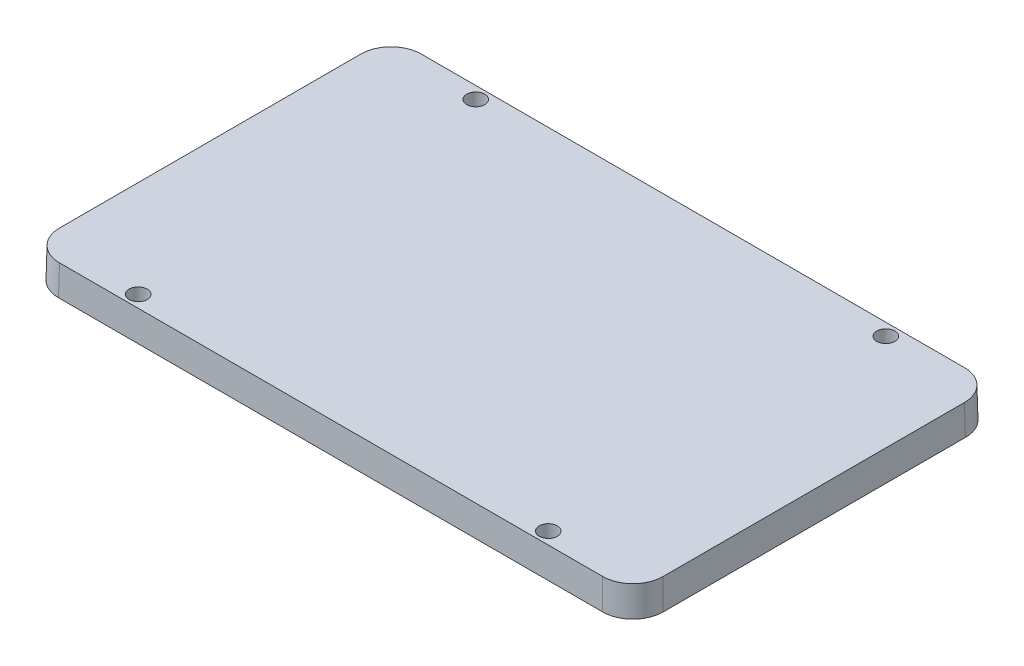
ISO-10303-21;
HEADER;
FILE_DESCRIPTION(('STEP AP214'),'2;1');
FILE_NAME('part.step','',(''),(''),'','','');
FILE_SCHEMA(('AUTOMOTIVE_DESIGN { 1 0 10303 214 1 1 1 1 }'));
ENDSEC;
DATA;
#1=APPLICATION_CONTEXT('core data for automotive mechanical design processes');
#2=APPLICATION_PROTOCOL_DEFINITION('international standard','automotive_design',2000,#1);
#3=PRODUCT_CONTEXT('',#1,'mechanical');
#4=PRODUCT('Part','Part','',(#3));
#5=PRODUCT_RELATED_PRODUCT_CATEGORY('part','',(#4));
#6=PRODUCT_DEFINITION_FORMATION('','',#4);
#7=PRODUCT_DEFINITION_CONTEXT('part definition',#1,'design');
#8=PRODUCT_DEFINITION('design','',#6,#7);
#9=PRODUCT_DEFINITION_SHAPE('','',#8);
#10=(LENGTH_UNIT() NAMED_UNIT(*) SI_UNIT(.MILLI.,.METRE.));
#11=(NAMED_UNIT(*) PLANE_ANGLE_UNIT() SI_UNIT($,.RADIAN.));
#12=(NAMED_UNIT(*) SI_UNIT($,.STERADIAN.) SOLID_ANGLE_UNIT());
#13=UNCERTAINTY_MEASURE_WITH_UNIT(LENGTH_MEASURE(1.E-05),#10,'distance_accuracy_value','');
#14=(GEOMETRIC_REPRESENTATION_CONTEXT(3) GLOBAL_UNCERTAINTY_ASSIGNED_CONTEXT((#13)) GLOBAL_UNIT_ASSIGNED_CONTEXT((#10,
#11,#12)) REPRESENTATION_CONTEXT('',''));
#15=CARTESIAN_POINT('',(0.,0.,0.));
#16=DIRECTION('',(0.,0.,1.));
#17=DIRECTION('',(1.,0.,0.));
#18=AXIS2_PLACEMENT_3D('',#15,#16,#17);
#19=CARTESIAN_POINT('',(52.5,-0.124913922395171,-31.5));
#20=DIRECTION('',(0.999847695156391,0.0174524064372835,0.));
#21=DIRECTION('',(-0.0174524064372835,0.999847695156391,0.));
#22=AXIS2_PLACEMENT_3D('',#19,#20,#21);
#23=PLANE('',#22);
#24=DIRECTION('',(0.,0.,1.));
#25=VECTOR('',#24,1.);
#26=CARTESIAN_POINT('',(52.4083609091269,5.12508607760483,-31.5));
#27=LINE('',#26,#25);
#28=CARTESIAN_POINT('',(52.4083609091269,5.12508607760483,26.1591605095558));
#29=VERTEX_POINT('',#28);
#30=CARTESIAN_POINT('',(52.4083609091269,5.12508607760483,-26.1591605095558));
#31=VERTEX_POINT('',#30);
#32=EDGE_CURVE('E130',#29,#31,#27,.F.);
#33=ORIENTED_EDGE('',*,*,#32,.F.);
#34=DIRECTION('',(-0.0174497491606827,0.999695459881888,-0.0174497491606827));
#35=VECTOR('',#34,1.);
#36=CARTESIAN_POINT('',(52.4824152427084,0.882516148126258,26.2332148431373));
#37=LINE('',#36,#35);
#38=CARTESIAN_POINT('',(52.5,-0.124913922395171,26.2507996004289));
#39=VERTEX_POINT('',#38);
#40=EDGE_CURVE('E114',#29,#39,#37,.F.);
#41=ORIENTED_EDGE('',*,*,#40,.T.);
#42=DIRECTION('',(0.,0.,-1.));
#43=VECTOR('',#42,1.);
#44=CARTESIAN_POINT('',(52.5,-0.124913922395171,-31.5));
#45=LINE('',#44,#43);
#46=CARTESIAN_POINT('',(52.5,-0.124913922395171,-26.2507996004289));
#47=VERTEX_POINT('',#46);
#48=EDGE_CURVE('E127',#39,#47,#45,.T.);
#49=ORIENTED_EDGE('',*,*,#48,.T.);
#50=DIRECTION('',(-0.0174497491606827,0.999695459881888,0.0174497491606827));
#51=VECTOR('',#50,1.);
#52=CARTESIAN_POINT('',(52.501598348692,-0.216483257630517,-26.2523979491209));
#53=LINE('',#52,#51);
#54=EDGE_CURVE('E133',#47,#31,#53,.T.);
#55=ORIENTED_EDGE('',*,*,#54,.T.);
#56=EDGE_LOOP('',(#33,#41,#49,#55));
#57=FACE_BOUND('',#56,.T.);
#58=ADVANCED_FACE('F43',(#57),#23,.T.);
#59=CARTESIAN_POINT('',(-52.5,-0.124913922395171,-31.5));
#60=DIRECTION('',(0.,0.0174524064372835,-0.999847695156391));
#61=DIRECTION('',(0.,0.999847695156391,0.0174524064372835));
#62=AXIS2_PLACEMENT_3D('',#59,#60,#61);
#63=PLANE('',#62);
#64=DIRECTION('',(1.,0.,0.));
#65=VECTOR('',#64,1.);
#66=CARTESIAN_POINT('',(-52.5,5.12508607760483,-31.4083609091269));
#67=LINE('',#66,#65);
#68=CARTESIAN_POINT('',(47.1591605095558,5.12508607760483,-31.4083609091269));
#69=VERTEX_POINT('',#68);
#70=CARTESIAN_POINT('',(-47.1591605095558,5.12508607760483,-31.4083609091269));
#71=VERTEX_POINT('',#70);
#72=EDGE_CURVE('E158',#69,#71,#67,.F.);
#73=ORIENTED_EDGE('',*,*,#72,.F.);
#74=DIRECTION('',(-0.0174497491606827,0.999695459881888,0.0174497491606827));
#75=VECTOR('',#74,1.);
#76=CARTESIAN_POINT('',(47.220426105815,1.61518241863077,-31.469626505386));
#77=LINE('',#76,#75);
#78=CARTESIAN_POINT('',(47.2507996004289,-0.124913922395171,-31.5));
#79=VERTEX_POINT('',#78);
#80=EDGE_CURVE('E196',#69,#79,#77,.F.);
#81=ORIENTED_EDGE('',*,*,#80,.T.);
#82=DIRECTION('',(-1.,0.,0.));
#83=VECTOR('',#82,1.);
#84=CARTESIAN_POINT('',(-52.5,-0.124913922395171,-31.5));
#85=LINE('',#84,#83);
#86=CARTESIAN_POINT('',(-47.2507996004289,-0.124913922395171,-31.5));
#87=VERTEX_POINT('',#86);
#88=EDGE_CURVE('E138',#79,#87,#85,.T.);
#89=ORIENTED_EDGE('',*,*,#88,.T.);
#90=DIRECTION('',(0.0174497491606827,0.999695459881888,0.0174497491606827));
#91=VECTOR('',#90,1.);
#92=CARTESIAN_POINT('',(-47.2523979491209,-0.216483257630517,-31.501598348692));
#93=LINE('',#92,#91);
#94=EDGE_CURVE('E193',#87,#71,#93,.T.);
#95=ORIENTED_EDGE('',*,*,#94,.T.);
#96=EDGE_LOOP('',(#73,#81,#89,#95));
#97=FACE_BOUND('',#96,.T.);
#98=ADVANCED_FACE('F203',(#97),#63,.T.);
#99=CARTESIAN_POINT('',(-52.5,-0.124913922395171,-31.5));
#100=DIRECTION('',(-0.999847695156391,0.0174524064372835,0.));
#101=DIRECTION('',(-0.0174524064372835,-0.999847695156391,0.));
#102=AXIS2_PLACEMENT_3D('',#99,#100,#101);
#103=PLANE('',#102);
#104=DIRECTION('',(0.,0.,-1.));
#105=VECTOR('',#104,1.);
#106=CARTESIAN_POINT('',(-52.4083609091269,5.12508607760483,-31.5));
#107=LINE('',#106,#105);
#108=CARTESIAN_POINT('',(-52.4083609091269,5.12508607760483,-26.1591605095558));
#109=VERTEX_POINT('',#108);
#110=CARTESIAN_POINT('',(-52.4083609091268,5.12508607760483,26.1591605095558));
#111=VERTEX_POINT('',#110);
#112=EDGE_CURVE('E161',#109,#111,#107,.F.);
#113=ORIENTED_EDGE('',*,*,#112,.F.);
#114=DIRECTION('',(0.0174497491606827,0.999695459881888,0.0174497491606827));
#115=VECTOR('',#114,1.);
#116=CARTESIAN_POINT('',(-52.501598348692,-0.216483257630517,-26.2523979491209));
#117=LINE('',#116,#115);
#118=CARTESIAN_POINT('',(-52.5,-0.124913922395171,-26.2507996004289));
#119=VERTEX_POINT('',#118);
#120=EDGE_CURVE('E11',#109,#119,#117,.F.);
#121=ORIENTED_EDGE('',*,*,#120,.T.);
#122=DIRECTION('',(0.,0.,1.));
#123=VECTOR('',#122,1.);
#124=CARTESIAN_POINT('',(-52.5,-0.124913922395171,-31.5));
#125=LINE('',#124,#123);
#126=CARTESIAN_POINT('',(-52.5,-0.124913922395171,26.2507996004289));
#127=VERTEX_POINT('',#126);
#128=EDGE_CURVE('E144',#119,#127,#125,.T.);
#129=ORIENTED_EDGE('',*,*,#128,.T.);
#130=DIRECTION('',(0.0174497491606827,0.999695459881888,-0.0174497491606827));
#131=VECTOR('',#130,1.);
#132=CARTESIAN_POINT('',(-52.4824152427084,0.882516148126257,26.2332148431373));
#133=LINE('',#132,#131);
#134=EDGE_CURVE('E52',#127,#111,#133,.T.);
#135=ORIENTED_EDGE('',*,*,#134,.T.);
#136=EDGE_LOOP('',(#113,#121,#129,#135));
#137=FACE_BOUND('',#136,.T.);
#138=ADVANCED_FACE('F211',(#137),#103,.T.);
#139=CARTESIAN_POINT('',(-52.5,-0.124913922395171,31.5));
#140=DIRECTION('',(0.,0.0174524064372835,0.999847695156391));
#141=DIRECTION('',(0.,-0.999847695156391,0.0174524064372835));
#142=AXIS2_PLACEMENT_3D('',#139,#140,#141);
#143=PLANE('',#142);
#144=DIRECTION('',(1.,0.,0.));
#145=VECTOR('',#144,1.);
#146=CARTESIAN_POINT('',(-52.5,-0.124913922395171,31.5));
#147=LINE('',#146,#145);
#148=CARTESIAN_POINT('',(-47.2507996004289,-0.124913922395171,31.5));
#149=VERTEX_POINT('',#148);
#150=CARTESIAN_POINT('',(47.250799600429,-0.124913922395171,31.5));
#151=VERTEX_POINT('',#150);
#152=EDGE_CURVE('E153',#149,#151,#147,.T.);
#153=ORIENTED_EDGE('',*,*,#152,.T.);
#154=DIRECTION('',(-0.0174497491606827,0.999695459881888,-0.0174497491606827));
#155=VECTOR('',#154,1.);
#156=CARTESIAN_POINT('',(47.220426105815,1.61518241863077,31.469626505386));
#157=LINE('',#156,#155);
#158=CARTESIAN_POINT('',(47.1591605095558,5.12508607760483,31.4083609091269));
#159=VERTEX_POINT('',#158);
#160=EDGE_CURVE('E115',#151,#159,#157,.T.);
#161=ORIENTED_EDGE('',*,*,#160,.T.);
#162=DIRECTION('',(-1.,0.,0.));
#163=VECTOR('',#162,1.);
#164=CARTESIAN_POINT('',(-52.5,5.12508607760483,31.4083609091269));
#165=LINE('',#164,#163);
#166=CARTESIAN_POINT('',(-47.1591605095558,5.12508607760483,31.4083609091269));
#167=VERTEX_POINT('',#166);
#168=EDGE_CURVE('E164',#167,#159,#165,.F.);
#169=ORIENTED_EDGE('',*,*,#168,.F.);
#170=DIRECTION('',(0.0174497491606827,0.999695459881888,-0.0174497491606827));
#171=VECTOR('',#170,1.);
#172=CARTESIAN_POINT('',(-47.2523979491209,-0.216483257630517,31.501598348692));
#173=LINE('',#172,#171);
#174=EDGE_CURVE('E121',#167,#149,#173,.F.);
#175=ORIENTED_EDGE('',*,*,#174,.T.);
#176=EDGE_LOOP('',(#153,#161,#169,#175));
#177=FACE_BOUND('',#176,.T.);
#178=ADVANCED_FACE('F218',(#177),#143,.T.);
#179=CARTESIAN_POINT('',(0.,5.12508607760483,0.));
#180=DIRECTION('',(0.,1.,0.));
#181=DIRECTION('',(0.,0.,1.));
#182=AXIS2_PLACEMENT_3D('',#179,#180,#181);
#183=PLANE('',#182);
#184=CARTESIAN_POINT('',(-35.6083609091269,5.12508607760483,29.3083609091269));
#185=DIRECTION('',(0.,-1.,0.));
#186=DIRECTION('',(0.,0.,1.));
#187=AXIS2_PLACEMENT_3D('',#184,#185,#186);
#188=CIRCLE('',#187,1.575);
#189=CARTESIAN_POINT('',(-35.6083609091269,5.12508607760483,30.8833609091269));
#190=VERTEX_POINT('',#189);
#191=EDGE_CURVE('E380',#190,#190,#188,.T.);
#192=ORIENTED_EDGE('',*,*,#191,.T.);
#193=EDGE_LOOP('',(#192));
#194=FACE_BOUND('',#193,.T.);
#195=CARTESIAN_POINT('',(-35.6083609091269,5.12508607760483,-29.3083609091269));
#196=DIRECTION('',(0.,1.,0.));
#197=DIRECTION('',(0.,0.,-1.));
#198=AXIS2_PLACEMENT_3D('',#195,#196,#197);
#199=CIRCLE('',#198,1.575);
#200=CARTESIAN_POINT('',(-35.6083609091269,5.12508607760483,-30.8833609091269));
#201=VERTEX_POINT('',#200);
#202=EDGE_CURVE('E384',#201,#201,#199,.T.);
#203=ORIENTED_EDGE('',*,*,#202,.F.);
#204=EDGE_LOOP('',(#203));
#205=FACE_BOUND('',#204,.T.);
#206=CARTESIAN_POINT('',(35.6083609091269,5.12508607760483,-29.3083609091269));
#207=DIRECTION('',(0.,-1.,0.));
#208=DIRECTION('',(0.,0.,-1.));
#209=AXIS2_PLACEMENT_3D('',#206,#207,#208);
#210=CIRCLE('',#209,1.575);
#211=CARTESIAN_POINT('',(35.6083609091269,5.12508607760483,-30.8833609091269));
#212=VERTEX_POINT('',#211);
#213=EDGE_CURVE('E394',#212,#212,#210,.T.);
#214=ORIENTED_EDGE('',*,*,#213,.T.);
#215=EDGE_LOOP('',(#214));
#216=FACE_BOUND('',#215,.T.);
#217=CARTESIAN_POINT('',(35.6083609091269,5.12508607760483,29.3083609091269));
#218=DIRECTION('',(0.,1.,0.));
#219=DIRECTION('',(0.,0.,1.));
#220=AXIS2_PLACEMENT_3D('',#217,#218,#219);
#221=CIRCLE('',#220,1.575);
#222=CARTESIAN_POINT('',(35.6083609091269,5.12508607760483,30.8833609091269));
#223=VERTEX_POINT('',#222);
#224=EDGE_CURVE('E147',#223,#223,#221,.T.);
#225=ORIENTED_EDGE('',*,*,#224,.F.);
#226=EDGE_LOOP('',(#225));
#227=FACE_BOUND('',#226,.T.);
#228=ORIENTED_EDGE('',*,*,#168,.T.);
#229=CARTESIAN_POINT('',(47.1575611868963,5.12508607760483,26.1575611868963));
#230=DIRECTION('',(0.,1.,0.));
#231=DIRECTION('',(0.707106781186548,0.,0.707106781186547));
#232=AXIS2_PLACEMENT_3D('',#229,#230,#231);
#233=ELLIPSE('',#232,5.25159932267801,5.25);
#234=EDGE_CURVE('E190',#159,#29,#233,.T.);
#235=ORIENTED_EDGE('',*,*,#234,.T.);
#236=ORIENTED_EDGE('',*,*,#32,.T.);
#237=CARTESIAN_POINT('',(47.1575611868963,5.12508607760483,-26.1575611868963));
#238=DIRECTION('',(0.,1.,0.));
#239=DIRECTION('',(0.707106781186547,0.,-0.707106781186548));
#240=AXIS2_PLACEMENT_3D('',#237,#238,#239);
#241=ELLIPSE('',#240,5.25159932267801,5.25);
#242=EDGE_CURVE('E187',#31,#69,#241,.T.);
#243=ORIENTED_EDGE('',*,*,#242,.T.);
#244=ORIENTED_EDGE('',*,*,#72,.T.);
#245=CARTESIAN_POINT('',(-47.1575611868963,5.12508607760483,-26.1575611868963));
#246=DIRECTION('',(0.,1.,0.));
#247=DIRECTION('',(-0.707106781186548,0.,-0.707106781186547));
#248=AXIS2_PLACEMENT_3D('',#245,#246,#247);
#249=ELLIPSE('',#248,5.25159932267801,5.25);
#250=EDGE_CURVE('E65',#71,#109,#249,.T.);
#251=ORIENTED_EDGE('',*,*,#250,.T.);
#252=ORIENTED_EDGE('',*,*,#112,.T.);
#253=CARTESIAN_POINT('',(-47.1575611868963,5.12508607760483,26.1575611868963));
#254=DIRECTION('',(0.,1.,0.));
#255=DIRECTION('',(-0.707106781186547,0.,0.707106781186548));
#256=AXIS2_PLACEMENT_3D('',#253,#254,#255);
#257=ELLIPSE('',#256,5.25159932267801,5.25);
#258=EDGE_CURVE('E182',#111,#167,#257,.T.);
#259=ORIENTED_EDGE('',*,*,#258,.T.);
#260=EDGE_LOOP('',(#228,#235,#236,#243,#244,#251,#252,#259));
#261=FACE_BOUND('',#260,.T.);
#262=ADVANCED_FACE('F213',(#194,#205,#216,#227,#261),#183,.T.);
#263=CARTESIAN_POINT('',(0.,-0.124913922395171,0.));
#264=DIRECTION('',(0.,1.,0.));
#265=DIRECTION('',(0.,0.,1.));
#266=AXIS2_PLACEMENT_3D('',#263,#264,#265);
#267=PLANE('',#266);
#268=CARTESIAN_POINT('',(-35.6083609091269,-0.124913922395171,29.3083609091269));
#269=DIRECTION('',(0.,1.,0.));
#270=DIRECTION('',(0.,0.,1.));
#271=AXIS2_PLACEMENT_3D('',#268,#269,#270);
#272=CIRCLE('',#271,1.66663909087315);
#273=CARTESIAN_POINT('',(-35.6083609091269,-0.124913922395171,30.975));
#274=VERTEX_POINT('',#273);
#275=EDGE_CURVE('E377',#274,#274,#272,.F.);
#276=ORIENTED_EDGE('',*,*,#275,.F.);
#277=EDGE_LOOP('',(#276));
#278=FACE_BOUND('',#277,.T.);
#279=CARTESIAN_POINT('',(-35.6083609091269,-0.124913922395171,-29.3083609091269));
#280=DIRECTION('',(0.,1.,0.));
#281=DIRECTION('',(0.,0.,1.));
#282=AXIS2_PLACEMENT_3D('',#279,#280,#281);
#283=CIRCLE('',#282,1.66663909087315);
#284=CARTESIAN_POINT('',(-35.6083609091269,-0.124913922395171,-27.6417218182537));
#285=VERTEX_POINT('',#284);
#286=EDGE_CURVE('E390',#285,#285,#283,.T.);
#287=ORIENTED_EDGE('',*,*,#286,.T.);
#288=EDGE_LOOP('',(#287));
#289=FACE_BOUND('',#288,.T.);
#290=CARTESIAN_POINT('',(35.6083609091269,-0.124913922395171,-29.3083609091269));
#291=DIRECTION('',(0.,1.,0.));
#292=DIRECTION('',(0.,0.,1.));
#293=AXIS2_PLACEMENT_3D('',#290,#291,#292);
#294=CIRCLE('',#293,1.66663909087315);
#295=CARTESIAN_POINT('',(35.6083609091269,-0.124913922395171,-27.6417218182537));
#296=VERTEX_POINT('',#295);
#297=EDGE_CURVE('E398',#296,#296,#294,.F.);
#298=ORIENTED_EDGE('',*,*,#297,.F.);
#299=EDGE_LOOP('',(#298));
#300=FACE_BOUND('',#299,.T.);
#301=CARTESIAN_POINT('',(35.6083609091269,-0.124913922395171,29.3083609091269));
#302=DIRECTION('',(0.,1.,0.));
#303=DIRECTION('',(0.,0.,1.));
#304=AXIS2_PLACEMENT_3D('',#301,#302,#303);
#305=CIRCLE('',#304,1.66663909087315);
#306=CARTESIAN_POINT('',(35.6083609091269,-0.124913922395171,30.975));
#307=VERTEX_POINT('',#306);
#308=EDGE_CURVE('E139',#307,#307,#305,.T.);
#309=ORIENTED_EDGE('',*,*,#308,.T.);
#310=EDGE_LOOP('',(#309));
#311=FACE_BOUND('',#310,.T.);
#312=ORIENTED_EDGE('',*,*,#48,.F.);
#313=CARTESIAN_POINT('',(47.2492002777695,-0.124913922395171,26.2492002777695));
#314=DIRECTION('',(0.,1.,0.));
#315=DIRECTION('',(0.707106781186548,0.,0.707106781186547));
#316=AXIS2_PLACEMENT_3D('',#313,#314,#315);
#317=ELLIPSE('',#316,5.25159932267801,5.25);
#318=EDGE_CURVE('E110',#39,#151,#317,.F.);
#319=ORIENTED_EDGE('',*,*,#318,.T.);
#320=ORIENTED_EDGE('',*,*,#152,.F.);
#321=CARTESIAN_POINT('',(-47.2492002777695,-0.124913922395171,26.2492002777695));
#322=DIRECTION('',(0.,1.,0.));
#323=DIRECTION('',(-0.707106781186547,0.,0.707106781186548));
#324=AXIS2_PLACEMENT_3D('',#321,#322,#323);
#325=ELLIPSE('',#324,5.25159932267801,5.25);
#326=EDGE_CURVE('E132',#149,#127,#325,.F.);
#327=ORIENTED_EDGE('',*,*,#326,.T.);
#328=ORIENTED_EDGE('',*,*,#128,.F.);
#329=CARTESIAN_POINT('',(-47.2492002777695,-0.124913922395171,-26.2492002777695));
#330=DIRECTION('',(0.,1.,0.));
#331=DIRECTION('',(-0.707106781186548,0.,-0.707106781186547));
#332=AXIS2_PLACEMENT_3D('',#329,#330,#331);
#333=ELLIPSE('',#332,5.25159932267801,5.25);
#334=EDGE_CURVE('E172',#119,#87,#333,.F.);
#335=ORIENTED_EDGE('',*,*,#334,.T.);
#336=ORIENTED_EDGE('',*,*,#88,.F.);
#337=CARTESIAN_POINT('',(47.2492002777695,-0.124913922395171,-26.2492002777695));
#338=DIRECTION('',(0.,1.,0.));
#339=DIRECTION('',(0.707106781186547,0.,-0.707106781186548));
#340=AXIS2_PLACEMENT_3D('',#337,#338,#339);
#341=ELLIPSE('',#340,5.25159932267801,5.25);
#342=EDGE_CURVE('E122',#79,#47,#341,.F.);
#343=ORIENTED_EDGE('',*,*,#342,.T.);
#344=EDGE_LOOP('',(#312,#319,#320,#327,#328,#335,#336,#343));
#345=FACE_BOUND('',#344,.T.);
#346=ADVANCED_FACE('F135',(#278,#289,#300,#311,#345),#267,.F.);
#347=CARTESIAN_POINT('',(47.2332148431374,0.790891014330519,26.2332148431374));
#348=DIRECTION('',(0.0174497491606827,-0.999695459881887,0.0174497491606827));
#349=DIRECTION('',(0.999847695156391,0.0174524064372836,0.));
#350=AXIS2_PLACEMENT_3D('',#347,#348,#349);
#351=CYLINDRICAL_SURFACE('',#350,5.25);
#352=ORIENTED_EDGE('',*,*,#234,.F.);
#353=ORIENTED_EDGE('',*,*,#160,.F.);
#354=ORIENTED_EDGE('',*,*,#318,.F.);
#355=ORIENTED_EDGE('',*,*,#40,.F.);
#356=EDGE_LOOP('',(#352,#353,#354,#355));
#357=FACE_BOUND('',#356,.T.);
#358=ADVANCED_FACE('F113',(#357),#351,.T.);
#359=CARTESIAN_POINT('',(47.220426105815,1.52355728483504,-26.220426105815));
#360=DIRECTION('',(0.0174497491606827,-0.999695459881887,-0.0174497491606827));
#361=DIRECTION('',(0.,0.0174524064372835,-0.999847695156391));
#362=AXIS2_PLACEMENT_3D('',#359,#360,#361);
#363=CYLINDRICAL_SURFACE('',#362,5.25);
#364=ORIENTED_EDGE('',*,*,#242,.F.);
#365=ORIENTED_EDGE('',*,*,#54,.F.);
#366=ORIENTED_EDGE('',*,*,#342,.F.);
#367=ORIENTED_EDGE('',*,*,#80,.F.);
#368=EDGE_LOOP('',(#364,#365,#366,#367));
#369=FACE_BOUND('',#368,.T.);
#370=ADVANCED_FACE('F219',(#369),#363,.T.);
#371=CARTESIAN_POINT('',(-47.2523979491209,-0.308108391426256,-26.2523979491209));
#372=DIRECTION('',(-0.0174497491606827,-0.999695459881887,-0.0174497491606827));
#373=DIRECTION('',(0.999847695156391,-0.0174524064372836,0.));
#374=AXIS2_PLACEMENT_3D('',#371,#372,#373);
#375=CYLINDRICAL_SURFACE('',#374,5.25);
#376=ORIENTED_EDGE('',*,*,#250,.F.);
#377=ORIENTED_EDGE('',*,*,#94,.F.);
#378=ORIENTED_EDGE('',*,*,#334,.F.);
#379=ORIENTED_EDGE('',*,*,#120,.F.);
#380=EDGE_LOOP('',(#376,#377,#378,#379));
#381=FACE_BOUND('',#380,.T.);
#382=ADVANCED_FACE('F210',(#381),#375,.T.);
#383=CARTESIAN_POINT('',(-47.2523979491209,-0.308108391426256,26.2523979491209));
#384=DIRECTION('',(-0.0174497491606827,-0.999695459881887,0.0174497491606827));
#385=DIRECTION('',(0.,-0.0174524064372835,-0.999847695156391));
#386=AXIS2_PLACEMENT_3D('',#383,#384,#385);
#387=CYLINDRICAL_SURFACE('',#386,5.25);
#388=ORIENTED_EDGE('',*,*,#258,.F.);
#389=ORIENTED_EDGE('',*,*,#134,.F.);
#390=ORIENTED_EDGE('',*,*,#326,.F.);
#391=ORIENTED_EDGE('',*,*,#174,.F.);
#392=EDGE_LOOP('',(#388,#389,#390,#391));
#393=FACE_BOUND('',#392,.T.);
#394=ADVANCED_FACE('F45',(#393),#387,.T.);
#395=CARTESIAN_POINT('',(35.6083609091269,5.12508607760483,29.3083609091269));
#396=DIRECTION('',(0.,-1.,0.));
#397=DIRECTION('',(0.,0.,1.));
#398=AXIS2_PLACEMENT_3D('',#395,#396,#397);
#399=CONICAL_SURFACE('',#398,1.575,0.0174532925199433);
#400=ORIENTED_EDGE('',*,*,#308,.F.);
#401=EDGE_LOOP('',(#400));
#402=FACE_BOUND('',#401,.T.);
#403=ORIENTED_EDGE('',*,*,#224,.T.);
#404=EDGE_LOOP('',(#403));
#405=FACE_BOUND('',#404,.T.);
#406=ADVANCED_FACE('F281',(#402,#405),#399,.F.);
#407=CARTESIAN_POINT('',(35.6083609091269,5.12508607760483,-29.3083609091269));
#408=DIRECTION('',(0.,-1.,0.));
#409=DIRECTION('',(0.,0.,-1.));
#410=AXIS2_PLACEMENT_3D('',#407,#408,#409);
#411=CONICAL_SURFACE('',#410,1.575,0.0174532925199433);
#412=ORIENTED_EDGE('',*,*,#297,.T.);
#413=EDGE_LOOP('',(#412));
#414=FACE_BOUND('',#413,.T.);
#415=ORIENTED_EDGE('',*,*,#213,.F.);
#416=EDGE_LOOP('',(#415));
#417=FACE_BOUND('',#416,.T.);
#418=ADVANCED_FACE('F289',(#414,#417),#411,.F.);
#419=CARTESIAN_POINT('',(-35.6083609091269,5.12508607760483,-29.3083609091269));
#420=DIRECTION('',(0.,-1.,0.));
#421=DIRECTION('',(0.,0.,-1.));
#422=AXIS2_PLACEMENT_3D('',#419,#420,#421);
#423=CONICAL_SURFACE('',#422,1.575,0.0174532925199433);
#424=ORIENTED_EDGE('',*,*,#286,.F.);
#425=EDGE_LOOP('',(#424));
#426=FACE_BOUND('',#425,.T.);
#427=ORIENTED_EDGE('',*,*,#202,.T.);
#428=EDGE_LOOP('',(#427));
#429=FACE_BOUND('',#428,.T.);
#430=ADVANCED_FACE('F301',(#426,#429),#423,.F.);
#431=CARTESIAN_POINT('',(-35.6083609091269,5.12508607760483,29.3083609091269));
#432=DIRECTION('',(0.,-1.,0.));
#433=DIRECTION('',(0.,0.,1.));
#434=AXIS2_PLACEMENT_3D('',#431,#432,#433);
#435=CONICAL_SURFACE('',#434,1.575,0.0174532925199433);
#436=ORIENTED_EDGE('',*,*,#275,.T.);
#437=EDGE_LOOP('',(#436));
#438=FACE_BOUND('',#437,.T.);
#439=ORIENTED_EDGE('',*,*,#191,.F.);
#440=EDGE_LOOP('',(#439));
#441=FACE_BOUND('',#440,.T.);
#442=ADVANCED_FACE('F311',(#438,#441),#435,.F.);
#443=CLOSED_SHELL('',(#58,#98,#138,#178,#262,#346,#358,#370,#382,#394,#406,#418,#430,#442));
#444=MANIFOLD_SOLID_BREP('B2',#443);
#445=ADVANCED_BREP_SHAPE_REPRESENTATION('',(#18,#444),#14);
#446=SHAPE_DEFINITION_REPRESENTATION(#9,#445);
ENDSEC;
END-ISO-10303-21;
